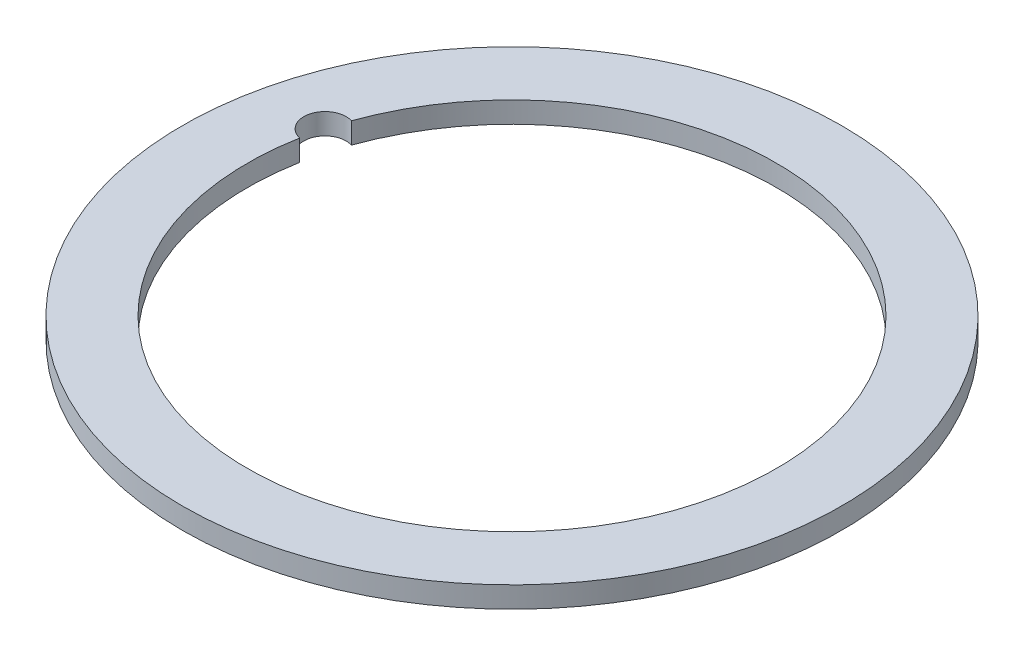
ISO-10303-21;
HEADER;
FILE_DESCRIPTION(('STEP AP214'),'2;1');
FILE_NAME('part.step','',(''),(''),'','','');
FILE_SCHEMA(('AUTOMOTIVE_DESIGN { 1 0 10303 214 1 1 1 1 }'));
ENDSEC;
DATA;
#1=APPLICATION_CONTEXT('core data for automotive mechanical design processes');
#2=APPLICATION_PROTOCOL_DEFINITION('international standard','automotive_design',2000,#1);
#3=PRODUCT_CONTEXT('',#1,'mechanical');
#4=PRODUCT('Part','Part','',(#3));
#5=PRODUCT_RELATED_PRODUCT_CATEGORY('part','',(#4));
#6=PRODUCT_DEFINITION_FORMATION('','',#4);
#7=PRODUCT_DEFINITION_CONTEXT('part definition',#1,'design');
#8=PRODUCT_DEFINITION('design','',#6,#7);
#9=PRODUCT_DEFINITION_SHAPE('','',#8);
#10=(LENGTH_UNIT() NAMED_UNIT(*) SI_UNIT(.MILLI.,.METRE.));
#11=(NAMED_UNIT(*) PLANE_ANGLE_UNIT() SI_UNIT($,.RADIAN.));
#12=(NAMED_UNIT(*) SI_UNIT($,.STERADIAN.) SOLID_ANGLE_UNIT());
#13=UNCERTAINTY_MEASURE_WITH_UNIT(LENGTH_MEASURE(1.E-05),#10,'distance_accuracy_value','');
#14=(GEOMETRIC_REPRESENTATION_CONTEXT(3) GLOBAL_UNCERTAINTY_ASSIGNED_CONTEXT((#13)) GLOBAL_UNIT_ASSIGNED_CONTEXT((#10,
#11,#12)) REPRESENTATION_CONTEXT('',''));
#15=CARTESIAN_POINT('',(0.,0.,0.));
#16=DIRECTION('',(0.,0.,1.));
#17=DIRECTION('',(1.,0.,0.));
#18=AXIS2_PLACEMENT_3D('',#15,#16,#17);
#19=CARTESIAN_POINT('',(0.,3.175,0.));
#20=DIRECTION('',(0.,-1.,0.));
#21=DIRECTION('',(0.,0.,-1.));
#22=AXIS2_PLACEMENT_3D('',#19,#20,#21);
#23=CYLINDRICAL_SURFACE('',#22,39.751);
#24=CARTESIAN_POINT('',(0.,3.175,0.));
#25=DIRECTION('',(0.,1.,0.));
#26=DIRECTION('',(0.,0.,1.));
#27=AXIS2_PLACEMENT_3D('',#24,#25,#26);
#28=CIRCLE('',#27,39.751);
#29=CARTESIAN_POINT('',(-39.0951358084424,3.175,-7.19113044795065));
#30=VERTEX_POINT('',#29);
#31=CARTESIAN_POINT('',(-37.4529459984893,3.175,-13.3198662543677));
#32=VERTEX_POINT('',#31);
#33=EDGE_CURVE('E78',#30,#32,#28,.T.);
#34=ORIENTED_EDGE('',*,*,#33,.T.);
#35=DIRECTION('',(0.,-1.,0.));
#36=VECTOR('',#35,1.);
#37=CARTESIAN_POINT('',(-37.4529459984893,1.5875,-13.3198662543677));
#38=LINE('',#37,#36);
#39=CARTESIAN_POINT('',(-37.4529459984893,0.,-13.3198662543677));
#40=VERTEX_POINT('',#39);
#41=EDGE_CURVE('E11',#32,#40,#38,.T.);
#42=ORIENTED_EDGE('',*,*,#41,.T.);
#43=CARTESIAN_POINT('',(0.,0.,0.));
#44=DIRECTION('',(0.,1.,0.));
#45=DIRECTION('',(0.,0.,1.));
#46=AXIS2_PLACEMENT_3D('',#43,#44,#45);
#47=CIRCLE('',#46,39.751);
#48=CARTESIAN_POINT('',(-39.0951358084424,0.,-7.19113044795065));
#49=VERTEX_POINT('',#48);
#50=EDGE_CURVE('E76',#49,#40,#47,.T.);
#51=ORIENTED_EDGE('',*,*,#50,.F.);
#52=DIRECTION('',(0.,-1.,0.));
#53=VECTOR('',#52,1.);
#54=CARTESIAN_POINT('',(-39.0951358084424,1.5875,-7.19113044795065));
#55=LINE('',#54,#53);
#56=EDGE_CURVE('E52',#49,#30,#55,.F.);
#57=ORIENTED_EDGE('',*,*,#56,.T.);
#58=EDGE_LOOP('',(#34,#42,#51,#57));
#59=FACE_BOUND('',#58,.T.);
#60=ADVANCED_FACE('F43',(#59),#23,.F.);
#61=CARTESIAN_POINT('',(0.,3.175,0.));
#62=DIRECTION('',(0.,1.,0.));
#63=DIRECTION('',(0.,0.,1.));
#64=AXIS2_PLACEMENT_3D('',#61,#62,#63);
#65=PLANE('',#64);
#66=CARTESIAN_POINT('',(0.,3.175,0.));
#67=DIRECTION('',(0.,1.,0.));
#68=DIRECTION('',(0.,0.,1.));
#69=AXIS2_PLACEMENT_3D('',#66,#67,#68);
#70=CIRCLE('',#69,49.53);
#71=CARTESIAN_POINT('',(0.,3.175,49.53));
#72=VERTEX_POINT('',#71);
#73=EDGE_CURVE('E89',#72,#72,#70,.T.);
#74=ORIENTED_EDGE('',*,*,#73,.T.);
#75=EDGE_LOOP('',(#74));
#76=FACE_BOUND('',#75,.T.);
#77=ORIENTED_EDGE('',*,*,#33,.F.);
#78=CARTESIAN_POINT('',(-38.3965175208168,3.175,-10.28831586187));
#79=DIRECTION('',(0.,1.,0.));
#80=DIRECTION('',(0.,0.,1.));
#81=AXIS2_PLACEMENT_3D('',#78,#79,#80);
#82=CIRCLE('',#81,3.175);
#83=EDGE_CURVE('E59',#32,#30,#82,.T.);
#84=ORIENTED_EDGE('',*,*,#83,.F.);
#85=EDGE_LOOP('',(#77,#84));
#86=FACE_BOUND('',#85,.T.);
#87=ADVANCED_FACE('F97',(#76,#86),#65,.T.);
#88=CARTESIAN_POINT('',(0.,0.,0.));
#89=DIRECTION('',(0.,1.,0.));
#90=DIRECTION('',(0.,0.,1.));
#91=AXIS2_PLACEMENT_3D('',#88,#89,#90);
#92=PLANE('',#91);
#93=CARTESIAN_POINT('',(-38.3965175208168,0.,-10.28831586187));
#94=DIRECTION('',(0.,1.,0.));
#95=DIRECTION('',(0.,0.,1.));
#96=AXIS2_PLACEMENT_3D('',#93,#94,#95);
#97=CIRCLE('',#96,3.175);
#98=EDGE_CURVE('E67',#40,#49,#97,.T.);
#99=ORIENTED_EDGE('',*,*,#98,.T.);
#100=ORIENTED_EDGE('',*,*,#50,.T.);
#101=EDGE_LOOP('',(#99,#100));
#102=FACE_BOUND('',#101,.T.);
#103=CARTESIAN_POINT('',(0.,0.,0.));
#104=DIRECTION('',(0.,1.,0.));
#105=DIRECTION('',(0.,0.,1.));
#106=AXIS2_PLACEMENT_3D('',#103,#104,#105);
#107=CIRCLE('',#106,49.53);
#108=CARTESIAN_POINT('',(0.,0.,49.53));
#109=VERTEX_POINT('',#108);
#110=EDGE_CURVE('E85',#109,#109,#107,.T.);
#111=ORIENTED_EDGE('',*,*,#110,.F.);
#112=EDGE_LOOP('',(#111));
#113=FACE_BOUND('',#112,.T.);
#114=ADVANCED_FACE('F79',(#102,#113),#92,.F.);
#115=CARTESIAN_POINT('',(0.,3.175,0.));
#116=DIRECTION('',(0.,-1.,0.));
#117=DIRECTION('',(0.,0.,-1.));
#118=AXIS2_PLACEMENT_3D('',#115,#116,#117);
#119=CYLINDRICAL_SURFACE('',#118,49.53);
#120=ORIENTED_EDGE('',*,*,#73,.F.);
#121=EDGE_LOOP('',(#120));
#122=FACE_BOUND('',#121,.T.);
#123=ORIENTED_EDGE('',*,*,#110,.T.);
#124=EDGE_LOOP('',(#123));
#125=FACE_BOUND('',#124,.T.);
#126=ADVANCED_FACE('F45',(#122,#125),#119,.T.);
#127=CARTESIAN_POINT('',(-38.3965175208168,3.175,-10.28831586187));
#128=DIRECTION('',(0.,-1.,0.));
#129=DIRECTION('',(0.,0.,-1.));
#130=AXIS2_PLACEMENT_3D('',#127,#128,#129);
#131=CYLINDRICAL_SURFACE('',#130,3.175);
#132=ORIENTED_EDGE('',*,*,#83,.T.);
#133=ORIENTED_EDGE('',*,*,#56,.F.);
#134=ORIENTED_EDGE('',*,*,#98,.F.);
#135=ORIENTED_EDGE('',*,*,#41,.F.);
#136=EDGE_LOOP('',(#132,#133,#134,#135));
#137=FACE_BOUND('',#136,.T.);
#138=ADVANCED_FACE('F68',(#137),#131,.F.);
#139=CLOSED_SHELL('',(#60,#87,#114,#126,#138));
#140=MANIFOLD_SOLID_BREP('B2',#139);
#141=ADVANCED_BREP_SHAPE_REPRESENTATION('',(#18,#140),#14);
#142=SHAPE_DEFINITION_REPRESENTATION(#9,#141);
ENDSEC;
END-ISO-10303-21;
